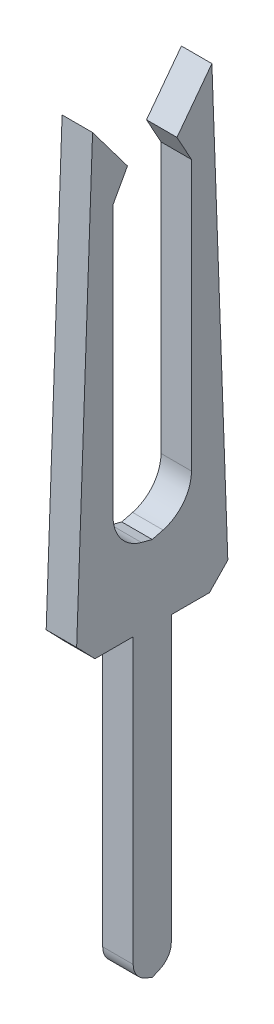
ISO-10303-21;
HEADER;
FILE_DESCRIPTION(('STEP AP214'),'2;1');
FILE_NAME('part.step','',(''),(''),'','','');
FILE_SCHEMA(('AUTOMOTIVE_DESIGN { 1 0 10303 214 1 1 1 1 }'));
ENDSEC;
DATA;
#1=APPLICATION_CONTEXT('core data for automotive mechanical design processes');
#2=APPLICATION_PROTOCOL_DEFINITION('international standard','automotive_design',2000,#1);
#3=PRODUCT_CONTEXT('',#1,'mechanical');
#4=PRODUCT('Part','Part','',(#3));
#5=PRODUCT_RELATED_PRODUCT_CATEGORY('part','',(#4));
#6=PRODUCT_DEFINITION_FORMATION('','',#4);
#7=PRODUCT_DEFINITION_CONTEXT('part definition',#1,'design');
#8=PRODUCT_DEFINITION('design','',#6,#7);
#9=PRODUCT_DEFINITION_SHAPE('','',#8);
#10=(LENGTH_UNIT() NAMED_UNIT(*) SI_UNIT(.MILLI.,.METRE.));
#11=(NAMED_UNIT(*) PLANE_ANGLE_UNIT() SI_UNIT($,.RADIAN.));
#12=(NAMED_UNIT(*) SI_UNIT($,.STERADIAN.) SOLID_ANGLE_UNIT());
#13=UNCERTAINTY_MEASURE_WITH_UNIT(LENGTH_MEASURE(1.E-05),#10,'distance_accuracy_value','');
#14=(GEOMETRIC_REPRESENTATION_CONTEXT(3) GLOBAL_UNCERTAINTY_ASSIGNED_CONTEXT((#13)) GLOBAL_UNIT_ASSIGNED_CONTEXT((#10,
#11,#12)) REPRESENTATION_CONTEXT('',''));
#15=CARTESIAN_POINT('',(0.,0.,0.));
#16=DIRECTION('',(0.,0.,1.));
#17=DIRECTION('',(1.,0.,0.));
#18=AXIS2_PLACEMENT_3D('',#15,#16,#17);
#19=CARTESIAN_POINT('',(0.4,2.15627423693323,0.277438328452502));
#20=DIRECTION('',(0.,0.694137309805425,0.71984261831048));
#21=DIRECTION('',(0.,-0.71984261831048,0.694137309805425));
#22=AXIS2_PLACEMENT_3D('',#19,#20,#21);
#23=PLANE('',#22);
#24=DIRECTION('',(0.,0.71984261831048,-0.694137309805425));
#25=VECTOR('',#24,1.);
#26=CARTESIAN_POINT('',(0.,2.15627423693323,0.277438328452502));
#27=LINE('',#26,#25);
#28=CARTESIAN_POINT('',(0.,1.90643942765456,0.518351630884458));
#29=VERTEX_POINT('',#28);
#30=CARTESIAN_POINT('',(0.,2.15627423693323,0.277438328452502));
#31=VERTEX_POINT('',#30);
#32=EDGE_CURVE('E212',#29,#31,#27,.T.);
#33=ORIENTED_EDGE('',*,*,#32,.T.);
#34=DIRECTION('',(-1.,0.,0.));
#35=VECTOR('',#34,1.);
#36=CARTESIAN_POINT('',(0.4,2.15627423693323,0.277438328452502));
#37=LINE('',#36,#35);
#38=CARTESIAN_POINT('',(0.4,2.15627423693323,0.277438328452502));
#39=VERTEX_POINT('',#38);
#40=EDGE_CURVE('E11',#39,#31,#37,.T.);
#41=ORIENTED_EDGE('',*,*,#40,.F.);
#42=DIRECTION('',(0.,0.71984261831048,-0.694137309805425));
#43=VECTOR('',#42,1.);
#44=CARTESIAN_POINT('',(0.4,2.15627423693323,0.277438328452502));
#45=LINE('',#44,#43);
#46=CARTESIAN_POINT('',(0.4,1.90643942765456,0.518351630884458));
#47=VERTEX_POINT('',#46);
#48=EDGE_CURVE('E254',#47,#39,#45,.T.);
#49=ORIENTED_EDGE('',*,*,#48,.F.);
#50=DIRECTION('',(-1.,0.,0.));
#51=VECTOR('',#50,1.);
#52=CARTESIAN_POINT('',(0.4,1.90643942765456,0.518351630884458));
#53=LINE('',#52,#51);
#54=EDGE_CURVE('E208',#47,#29,#53,.T.);
#55=ORIENTED_EDGE('',*,*,#54,.T.);
#56=EDGE_LOOP('',(#33,#41,#49,#55));
#57=FACE_BOUND('',#56,.T.);
#58=ADVANCED_FACE('F32',(#57),#23,.F.);
#59=CARTESIAN_POINT('',(0.4,7.90643942765456,0.486576567456251));
#60=DIRECTION('',(0.,-0.036346790272175,0.99933923711466));
#61=DIRECTION('',(0.,-0.99933923711466,-0.036346790272175));
#62=AXIS2_PLACEMENT_3D('',#59,#60,#61);
#63=PLANE('',#62);
#64=DIRECTION('',(0.,0.99933923711466,0.036346790272175));
#65=VECTOR('',#64,1.);
#66=CARTESIAN_POINT('',(0.,7.90643942765456,0.486576567456251));
#67=LINE('',#66,#65);
#68=CARTESIAN_POINT('',(0.,7.90643942765456,0.486576567456251));
#69=VERTEX_POINT('',#68);
#70=EDGE_CURVE('E215',#31,#69,#67,.T.);
#71=ORIENTED_EDGE('',*,*,#70,.T.);
#72=DIRECTION('',(-1.,0.,0.));
#73=VECTOR('',#72,1.);
#74=CARTESIAN_POINT('',(0.4,7.90643942765456,0.486576567456251));
#75=LINE('',#74,#73);
#76=CARTESIAN_POINT('',(0.4,7.90643942765456,0.486576567456251));
#77=VERTEX_POINT('',#76);
#78=EDGE_CURVE('E40',#77,#69,#75,.T.);
#79=ORIENTED_EDGE('',*,*,#78,.F.);
#80=DIRECTION('',(0.,0.99933923711466,0.036346790272175));
#81=VECTOR('',#80,1.);
#82=CARTESIAN_POINT('',(0.4,7.90643942765456,0.486576567456251));
#83=LINE('',#82,#81);
#84=EDGE_CURVE('E133',#39,#77,#83,.T.);
#85=ORIENTED_EDGE('',*,*,#84,.F.);
#86=ORIENTED_EDGE('',*,*,#40,.T.);
#87=EDGE_LOOP('',(#71,#79,#85,#86));
#88=FACE_BOUND('',#87,.T.);
#89=ADVANCED_FACE('F382',(#88),#63,.F.);
#90=CARTESIAN_POINT('',(0.4,7.29691604158744,0.944947879463951));
#91=DIRECTION('',(0.,-0.601030672473663,-0.799225957252301));
#92=DIRECTION('',(0.,0.799225957252301,-0.601030672473663));
#93=AXIS2_PLACEMENT_3D('',#90,#91,#92);
#94=PLANE('',#93);
#95=DIRECTION('',(0.,-0.799225957252301,0.601030672473663));
#96=VECTOR('',#95,1.);
#97=CARTESIAN_POINT('',(0.,7.29691604158744,0.944947879463951));
#98=LINE('',#97,#96);
#99=CARTESIAN_POINT('',(0.,7.29691604158744,0.944947879463951));
#100=VERTEX_POINT('',#99);
#101=EDGE_CURVE('E217',#69,#100,#98,.T.);
#102=ORIENTED_EDGE('',*,*,#101,.T.);
#103=DIRECTION('',(-1.,0.,0.));
#104=VECTOR('',#103,1.);
#105=CARTESIAN_POINT('',(0.4,7.29691604158744,0.944947879463951));
#106=LINE('',#105,#104);
#107=CARTESIAN_POINT('',(0.4,7.29691604158744,0.944947879463951));
#108=VERTEX_POINT('',#107);
#109=EDGE_CURVE('E303',#108,#100,#106,.T.);
#110=ORIENTED_EDGE('',*,*,#109,.F.);
#111=DIRECTION('',(0.,-0.799225957252301,0.601030672473663));
#112=VECTOR('',#111,1.);
#113=CARTESIAN_POINT('',(0.4,7.29691604158744,0.944947879463951));
#114=LINE('',#113,#112);
#115=EDGE_CURVE('E311',#77,#108,#114,.T.);
#116=ORIENTED_EDGE('',*,*,#115,.F.);
#117=ORIENTED_EDGE('',*,*,#78,.T.);
#118=EDGE_LOOP('',(#102,#110,#116,#117));
#119=FACE_BOUND('',#118,.T.);
#120=ADVANCED_FACE('F309',(#119),#94,.F.);
#121=CARTESIAN_POINT('',(0.4,6.95011825296304,0.754777343997982));
#122=DIRECTION('',(0.,0.480815317239039,-0.876821892238283));
#123=DIRECTION('',(0.,0.876821892238283,0.480815317239039));
#124=AXIS2_PLACEMENT_3D('',#121,#122,#123);
#125=PLANE('',#124);
#126=DIRECTION('',(0.,-0.876821892238283,-0.480815317239039));
#127=VECTOR('',#126,1.);
#128=CARTESIAN_POINT('',(0.,6.95011825296304,0.754777343997982));
#129=LINE('',#128,#127);
#130=CARTESIAN_POINT('',(0.,6.95011825296304,0.754777343997982));
#131=VERTEX_POINT('',#130);
#132=EDGE_CURVE('E219',#100,#131,#129,.T.);
#133=ORIENTED_EDGE('',*,*,#132,.T.);
#134=DIRECTION('',(-1.,0.,0.));
#135=VECTOR('',#134,1.);
#136=CARTESIAN_POINT('',(0.4,6.95011825296304,0.754777343997982));
#137=LINE('',#136,#135);
#138=CARTESIAN_POINT('',(0.4,6.95011825296304,0.754777343997982));
#139=VERTEX_POINT('',#138);
#140=EDGE_CURVE('E300',#139,#131,#137,.T.);
#141=ORIENTED_EDGE('',*,*,#140,.F.);
#142=DIRECTION('',(0.,-0.876821892238283,-0.480815317239039));
#143=VECTOR('',#142,1.);
#144=CARTESIAN_POINT('',(0.4,6.95011825296304,0.754777343997982));
#145=LINE('',#144,#143);
#146=EDGE_CURVE('E329',#108,#139,#145,.T.);
#147=ORIENTED_EDGE('',*,*,#146,.F.);
#148=ORIENTED_EDGE('',*,*,#109,.T.);
#149=EDGE_LOOP('',(#133,#141,#147,#148));
#150=FACE_BOUND('',#149,.T.);
#151=ADVANCED_FACE('F320',(#150),#125,.F.);
#152=CARTESIAN_POINT('',(0.4,3.40759606010662,0.754710604299908));
#153=DIRECTION('',(0.,1.88395991410638E-05,-0.999999999822535));
#154=DIRECTION('',(0.,0.999999999822535,1.88395991410638E-05));
#155=AXIS2_PLACEMENT_3D('',#152,#153,#154);
#156=PLANE('',#155);
#157=DIRECTION('',(0.,-0.999999999822535,-1.88395991410638E-05));
#158=VECTOR('',#157,1.);
#159=CARTESIAN_POINT('',(0.,3.40759606010662,0.754710604299908));
#160=LINE('',#159,#158);
#161=CARTESIAN_POINT('',(0.,3.40759606010662,0.754710604299908));
#162=VERTEX_POINT('',#161);
#163=EDGE_CURVE('E221',#131,#162,#160,.T.);
#164=ORIENTED_EDGE('',*,*,#163,.T.);
#165=DIRECTION('',(-1.,0.,0.));
#166=VECTOR('',#165,1.);
#167=CARTESIAN_POINT('',(0.4,3.40759606010662,0.754710604299908));
#168=LINE('',#167,#166);
#169=CARTESIAN_POINT('',(0.4,3.40759606010662,0.754710604299908));
#170=VERTEX_POINT('',#169);
#171=EDGE_CURVE('E297',#170,#162,#168,.T.);
#172=ORIENTED_EDGE('',*,*,#171,.F.);
#173=DIRECTION('',(0.,-0.999999999822535,-1.88395991410638E-05));
#174=VECTOR('',#173,1.);
#175=CARTESIAN_POINT('',(0.4,3.40759606010662,0.754710604299908));
#176=LINE('',#175,#174);
#177=EDGE_CURVE('E326',#139,#170,#176,.T.);
#178=ORIENTED_EDGE('',*,*,#177,.F.);
#179=ORIENTED_EDGE('',*,*,#140,.T.);
#180=EDGE_LOOP('',(#164,#172,#178,#179));
#181=FACE_BOUND('',#180,.T.);
#182=ADVANCED_FACE('F324',(#181),#156,.F.);
#183=CARTESIAN_POINT('',(0.4,3.40758664030705,1.25471060421118));
#184=DIRECTION('',(-1.,0.,0.));
#185=DIRECTION('',(0.,0.,1.));
#186=AXIS2_PLACEMENT_3D('',#183,#184,#185);
#187=CYLINDRICAL_SURFACE('',#186,0.5);
#188=CARTESIAN_POINT('',(0.,3.40758664030705,1.25471060421118));
#189=DIRECTION('',(-1.,0.,0.));
#190=DIRECTION('',(0.,0.,-1.));
#191=AXIS2_PLACEMENT_3D('',#188,#189,#190);
#192=CIRCLE('',#191,0.5);
#193=CARTESIAN_POINT('',(0.,2.92391221511593,1.127986295509));
#194=VERTEX_POINT('',#193);
#195=EDGE_CURVE('E223',#162,#194,#192,.T.);
#196=ORIENTED_EDGE('',*,*,#195,.T.);
#197=DIRECTION('',(-1.,0.,0.));
#198=VECTOR('',#197,1.);
#199=CARTESIAN_POINT('',(0.4,2.92391221511593,1.127986295509));
#200=LINE('',#199,#198);
#201=CARTESIAN_POINT('',(0.4,2.92391221511593,1.127986295509));
#202=VERTEX_POINT('',#201);
#203=EDGE_CURVE('E294',#202,#194,#200,.T.);
#204=ORIENTED_EDGE('',*,*,#203,.F.);
#205=CARTESIAN_POINT('',(0.4,3.40758664030705,1.25471060421118));
#206=DIRECTION('',(-1.,0.,0.));
#207=DIRECTION('',(0.,0.,-1.));
#208=AXIS2_PLACEMENT_3D('',#205,#206,#207);
#209=CIRCLE('',#208,0.5);
#210=EDGE_CURVE('E328',#170,#202,#209,.T.);
#211=ORIENTED_EDGE('',*,*,#210,.F.);
#212=ORIENTED_EDGE('',*,*,#171,.T.);
#213=EDGE_LOOP('',(#196,#204,#211,#212));
#214=FACE_BOUND('',#213,.T.);
#215=ADVANCED_FACE('F395',(#214),#187,.F.);
#216=CARTESIAN_POINT('',(0.4,2.88671780777912,1.26994787946395));
#217=DIRECTION('',(0.,-0.967348850382229,-0.253448617404358));
#218=DIRECTION('',(0.,0.253448617404358,-0.967348850382229));
#219=AXIS2_PLACEMENT_3D('',#216,#217,#218);
#220=PLANE('',#219);
#221=DIRECTION('',(0.,-0.253448617404358,0.967348850382229));
#222=VECTOR('',#221,1.);
#223=CARTESIAN_POINT('',(0.,2.88671780777912,1.26994787946395));
#224=LINE('',#223,#222);
#225=CARTESIAN_POINT('',(0.,2.88671780777912,1.26994787946395));
#226=VERTEX_POINT('',#225);
#227=EDGE_CURVE('E225',#194,#226,#224,.T.);
#228=ORIENTED_EDGE('',*,*,#227,.T.);
#229=DIRECTION('',(-1.,0.,0.));
#230=VECTOR('',#229,1.);
#231=CARTESIAN_POINT('',(0.4,2.88671780777912,1.26994787946395));
#232=LINE('',#231,#230);
#233=CARTESIAN_POINT('',(0.4,2.88671780777912,1.26994787946395));
#234=VERTEX_POINT('',#233);
#235=EDGE_CURVE('E291',#234,#226,#232,.T.);
#236=ORIENTED_EDGE('',*,*,#235,.F.);
#237=DIRECTION('',(0.,-0.253448617404358,0.967348850382229));
#238=VECTOR('',#237,1.);
#239=CARTESIAN_POINT('',(0.4,2.88671780777912,1.26994787946395));
#240=LINE('',#239,#238);
#241=EDGE_CURVE('E331',#202,#234,#240,.T.);
#242=ORIENTED_EDGE('',*,*,#241,.F.);
#243=ORIENTED_EDGE('',*,*,#203,.T.);
#244=EDGE_LOOP('',(#228,#236,#242,#243));
#245=FACE_BOUND('',#244,.T.);
#246=ADVANCED_FACE('F398',(#245),#220,.F.);
#247=CARTESIAN_POINT('',(0.4,2.88671780777912,1.26994787946395));
#248=DIRECTION('',(0.,-0.967348850382229,0.253448617404358));
#249=DIRECTION('',(0.,-0.253448617404358,-0.967348850382229));
#250=AXIS2_PLACEMENT_3D('',#247,#248,#249);
#251=PLANE('',#250);
#252=DIRECTION('',(0.,0.253448617404358,0.967348850382229));
#253=VECTOR('',#252,1.);
#254=CARTESIAN_POINT('',(0.,2.88671780777912,1.26994787946395));
#255=LINE('',#254,#253);
#256=CARTESIAN_POINT('',(0.,2.92391221511593,1.4119094634189));
#257=VERTEX_POINT('',#256);
#258=EDGE_CURVE('E227',#226,#257,#255,.T.);
#259=ORIENTED_EDGE('',*,*,#258,.T.);
#260=DIRECTION('',(-1.,0.,0.));
#261=VECTOR('',#260,1.);
#262=CARTESIAN_POINT('',(0.4,2.92391221511593,1.4119094634189));
#263=LINE('',#262,#261);
#264=CARTESIAN_POINT('',(0.4,2.92391221511593,1.4119094634189));
#265=VERTEX_POINT('',#264);
#266=EDGE_CURVE('E288',#265,#257,#263,.T.);
#267=ORIENTED_EDGE('',*,*,#266,.F.);
#268=DIRECTION('',(0.,0.253448617404358,0.967348850382229));
#269=VECTOR('',#268,1.);
#270=CARTESIAN_POINT('',(0.4,2.88671780777912,1.26994787946395));
#271=LINE('',#270,#269);
#272=EDGE_CURVE('E337',#234,#265,#271,.T.);
#273=ORIENTED_EDGE('',*,*,#272,.F.);
#274=ORIENTED_EDGE('',*,*,#235,.T.);
#275=EDGE_LOOP('',(#259,#267,#273,#274));
#276=FACE_BOUND('',#275,.T.);
#277=ADVANCED_FACE('F402',(#276),#251,.F.);
#278=CARTESIAN_POINT('',(0.4,3.40758664030705,1.28518515471672));
#279=DIRECTION('',(-1.,0.,0.));
#280=DIRECTION('',(0.,0.,1.));
#281=AXIS2_PLACEMENT_3D('',#278,#279,#280);
#282=CYLINDRICAL_SURFACE('',#281,0.5);
#283=CARTESIAN_POINT('',(0.,3.40758664030705,1.28518515471672));
#284=DIRECTION('',(-1.,0.,0.));
#285=DIRECTION('',(0.,0.,1.));
#286=AXIS2_PLACEMENT_3D('',#283,#284,#285);
#287=CIRCLE('',#286,0.5);
#288=CARTESIAN_POINT('',(0.,3.40759606010662,1.78518515462799));
#289=VERTEX_POINT('',#288);
#290=EDGE_CURVE('E229',#257,#289,#287,.T.);
#291=ORIENTED_EDGE('',*,*,#290,.T.);
#292=DIRECTION('',(-1.,0.,0.));
#293=VECTOR('',#292,1.);
#294=CARTESIAN_POINT('',(0.4,3.40759606010662,1.78518515462799));
#295=LINE('',#294,#293);
#296=CARTESIAN_POINT('',(0.4,3.40759606010662,1.78518515462799));
#297=VERTEX_POINT('',#296);
#298=EDGE_CURVE('E285',#297,#289,#295,.T.);
#299=ORIENTED_EDGE('',*,*,#298,.F.);
#300=CARTESIAN_POINT('',(0.4,3.40758664030705,1.28518515471672));
#301=DIRECTION('',(-1.,0.,0.));
#302=DIRECTION('',(0.,0.,1.));
#303=AXIS2_PLACEMENT_3D('',#300,#301,#302);
#304=CIRCLE('',#303,0.5);
#305=EDGE_CURVE('E339',#265,#297,#304,.T.);
#306=ORIENTED_EDGE('',*,*,#305,.F.);
#307=ORIENTED_EDGE('',*,*,#266,.T.);
#308=EDGE_LOOP('',(#291,#299,#306,#307));
#309=FACE_BOUND('',#308,.T.);
#310=ADVANCED_FACE('F406',(#309),#282,.F.);
#311=CARTESIAN_POINT('',(0.4,3.40759606010662,1.78518515462799));
#312=DIRECTION('',(0.,1.88395991408802E-05,0.999999999822535));
#313=DIRECTION('',(0.,-0.999999999822535,1.88395991408802E-05));
#314=AXIS2_PLACEMENT_3D('',#311,#312,#313);
#315=PLANE('',#314);
#316=DIRECTION('',(0.,0.999999999822535,-1.88395991408802E-05));
#317=VECTOR('',#316,1.);
#318=CARTESIAN_POINT('',(0.,3.40759606010662,1.78518515462799));
#319=LINE('',#318,#317);
#320=CARTESIAN_POINT('',(0.,6.95011825296304,1.78511841492992));
#321=VERTEX_POINT('',#320);
#322=EDGE_CURVE('E231',#289,#321,#319,.T.);
#323=ORIENTED_EDGE('',*,*,#322,.T.);
#324=DIRECTION('',(-1.,0.,0.));
#325=VECTOR('',#324,1.);
#326=CARTESIAN_POINT('',(0.4,6.95011825296304,1.78511841492992));
#327=LINE('',#326,#325);
#328=CARTESIAN_POINT('',(0.4,6.95011825296304,1.78511841492992));
#329=VERTEX_POINT('',#328);
#330=EDGE_CURVE('E282',#329,#321,#327,.T.);
#331=ORIENTED_EDGE('',*,*,#330,.F.);
#332=DIRECTION('',(0.,0.999999999822535,-1.88395991408802E-05));
#333=VECTOR('',#332,1.);
#334=CARTESIAN_POINT('',(0.4,3.40759606010662,1.78518515462799));
#335=LINE('',#334,#333);
#336=EDGE_CURVE('E341',#297,#329,#335,.T.);
#337=ORIENTED_EDGE('',*,*,#336,.F.);
#338=ORIENTED_EDGE('',*,*,#298,.T.);
#339=EDGE_LOOP('',(#323,#331,#337,#338));
#340=FACE_BOUND('',#339,.T.);
#341=ADVANCED_FACE('F410',(#340),#315,.F.);
#342=CARTESIAN_POINT('',(0.4,6.95011825296304,1.78511841492992));
#343=DIRECTION('',(0.,0.480815317239038,0.876821892238283));
#344=DIRECTION('',(0.,-0.876821892238283,0.480815317239038));
#345=AXIS2_PLACEMENT_3D('',#342,#343,#344);
#346=PLANE('',#345);
#347=DIRECTION('',(0.,0.876821892238283,-0.480815317239038));
#348=VECTOR('',#347,1.);
#349=CARTESIAN_POINT('',(0.,6.95011825296304,1.78511841492992));
#350=LINE('',#349,#348);
#351=CARTESIAN_POINT('',(0.,7.29691604158744,1.59494787946395));
#352=VERTEX_POINT('',#351);
#353=EDGE_CURVE('E233',#321,#352,#350,.T.);
#354=ORIENTED_EDGE('',*,*,#353,.T.);
#355=DIRECTION('',(-1.,0.,0.));
#356=VECTOR('',#355,1.);
#357=CARTESIAN_POINT('',(0.4,7.29691604158744,1.59494787946395));
#358=LINE('',#357,#356);
#359=CARTESIAN_POINT('',(0.4,7.29691604158744,1.59494787946395));
#360=VERTEX_POINT('',#359);
#361=EDGE_CURVE('E279',#360,#352,#358,.T.);
#362=ORIENTED_EDGE('',*,*,#361,.F.);
#363=DIRECTION('',(0.,0.876821892238283,-0.480815317239038));
#364=VECTOR('',#363,1.);
#365=CARTESIAN_POINT('',(0.4,6.95011825296304,1.78511841492992));
#366=LINE('',#365,#364);
#367=EDGE_CURVE('E343',#329,#360,#366,.T.);
#368=ORIENTED_EDGE('',*,*,#367,.F.);
#369=ORIENTED_EDGE('',*,*,#330,.T.);
#370=EDGE_LOOP('',(#354,#362,#368,#369));
#371=FACE_BOUND('',#370,.T.);
#372=ADVANCED_FACE('F414',(#371),#346,.F.);
#373=CARTESIAN_POINT('',(0.4,7.29691604158744,1.59494787946395));
#374=DIRECTION('',(0.,-0.601030672473662,0.799225957252301));
#375=DIRECTION('',(0.,-0.799225957252301,-0.601030672473662));
#376=AXIS2_PLACEMENT_3D('',#373,#374,#375);
#377=PLANE('',#376);
#378=DIRECTION('',(0.,0.799225957252301,0.601030672473662));
#379=VECTOR('',#378,1.);
#380=CARTESIAN_POINT('',(0.,7.29691604158744,1.59494787946395));
#381=LINE('',#380,#379);
#382=CARTESIAN_POINT('',(0.,7.90643942765456,2.05331919147165));
#383=VERTEX_POINT('',#382);
#384=EDGE_CURVE('E235',#352,#383,#381,.T.);
#385=ORIENTED_EDGE('',*,*,#384,.T.);
#386=DIRECTION('',(-1.,0.,0.));
#387=VECTOR('',#386,1.);
#388=CARTESIAN_POINT('',(0.4,7.90643942765456,2.05331919147165));
#389=LINE('',#388,#387);
#390=CARTESIAN_POINT('',(0.4,7.90643942765456,2.05331919147165));
#391=VERTEX_POINT('',#390);
#392=EDGE_CURVE('E276',#391,#383,#389,.T.);
#393=ORIENTED_EDGE('',*,*,#392,.F.);
#394=DIRECTION('',(0.,0.799225957252301,0.601030672473662));
#395=VECTOR('',#394,1.);
#396=CARTESIAN_POINT('',(0.4,7.29691604158744,1.59494787946395));
#397=LINE('',#396,#395);
#398=EDGE_CURVE('E345',#360,#391,#397,.T.);
#399=ORIENTED_EDGE('',*,*,#398,.F.);
#400=ORIENTED_EDGE('',*,*,#361,.T.);
#401=EDGE_LOOP('',(#385,#393,#399,#400));
#402=FACE_BOUND('',#401,.T.);
#403=ADVANCED_FACE('F418',(#402),#377,.F.);
#404=CARTESIAN_POINT('',(0.4,7.90643942765456,2.05331919147165));
#405=DIRECTION('',(0.,-0.0363467902721749,-0.99933923711466));
#406=DIRECTION('',(0.,0.99933923711466,-0.0363467902721749));
#407=AXIS2_PLACEMENT_3D('',#404,#405,#406);
#408=PLANE('',#407);
#409=DIRECTION('',(0.,-0.99933923711466,0.0363467902721749));
#410=VECTOR('',#409,1.);
#411=CARTESIAN_POINT('',(0.,7.90643942765456,2.05331919147165));
#412=LINE('',#411,#410);
#413=CARTESIAN_POINT('',(0.,2.15627423693323,2.26245743047539));
#414=VERTEX_POINT('',#413);
#415=EDGE_CURVE('E237',#383,#414,#412,.T.);
#416=ORIENTED_EDGE('',*,*,#415,.T.);
#417=DIRECTION('',(-1.,0.,0.));
#418=VECTOR('',#417,1.);
#419=CARTESIAN_POINT('',(0.4,2.15627423693323,2.26245743047539));
#420=LINE('',#419,#418);
#421=CARTESIAN_POINT('',(0.4,2.15627423693323,2.26245743047539));
#422=VERTEX_POINT('',#421);
#423=EDGE_CURVE('E273',#422,#414,#420,.T.);
#424=ORIENTED_EDGE('',*,*,#423,.F.);
#425=DIRECTION('',(0.,-0.99933923711466,0.0363467902721749));
#426=VECTOR('',#425,1.);
#427=CARTESIAN_POINT('',(0.4,7.90643942765456,2.05331919147165));
#428=LINE('',#427,#426);
#429=EDGE_CURVE('E347',#391,#422,#428,.T.);
#430=ORIENTED_EDGE('',*,*,#429,.F.);
#431=ORIENTED_EDGE('',*,*,#392,.T.);
#432=EDGE_LOOP('',(#416,#424,#430,#431));
#433=FACE_BOUND('',#432,.T.);
#434=ADVANCED_FACE('F422',(#433),#408,.F.);
#435=CARTESIAN_POINT('',(0.4,2.15627423693323,2.26245743047539));
#436=DIRECTION('',(0.,0.694137309805425,-0.71984261831048));
#437=DIRECTION('',(0.,0.71984261831048,0.694137309805426));
#438=AXIS2_PLACEMENT_3D('',#435,#436,#437);
#439=PLANE('',#438);
#440=DIRECTION('',(0.,-0.71984261831048,-0.694137309805426));
#441=VECTOR('',#440,1.);
#442=CARTESIAN_POINT('',(0.,2.15627423693323,2.26245743047539));
#443=LINE('',#442,#441);
#444=CARTESIAN_POINT('',(0.,1.90643942765456,2.02154412804344));
#445=VERTEX_POINT('',#444);
#446=EDGE_CURVE('E239',#414,#445,#443,.T.);
#447=ORIENTED_EDGE('',*,*,#446,.T.);
#448=DIRECTION('',(-1.,0.,0.));
#449=VECTOR('',#448,1.);
#450=CARTESIAN_POINT('',(0.4,1.90643942765456,2.02154412804344));
#451=LINE('',#450,#449);
#452=CARTESIAN_POINT('',(0.4,1.90643942765456,2.02154412804344));
#453=VERTEX_POINT('',#452);
#454=EDGE_CURVE('E270',#453,#445,#451,.T.);
#455=ORIENTED_EDGE('',*,*,#454,.F.);
#456=DIRECTION('',(0.,-0.71984261831048,-0.694137309805426));
#457=VECTOR('',#456,1.);
#458=CARTESIAN_POINT('',(0.4,2.15627423693323,2.26245743047539));
#459=LINE('',#458,#457);
#460=EDGE_CURVE('E349',#422,#453,#459,.T.);
#461=ORIENTED_EDGE('',*,*,#460,.F.);
#462=ORIENTED_EDGE('',*,*,#423,.T.);
#463=EDGE_LOOP('',(#447,#455,#461,#462));
#464=FACE_BOUND('',#463,.T.);
#465=ADVANCED_FACE('F426',(#464),#439,.F.);
#466=CARTESIAN_POINT('',(0.4,1.90643942765456,2.02154412804344));
#467=DIRECTION('',(0.,1.,0.));
#468=DIRECTION('',(0.,0.,1.));
#469=AXIS2_PLACEMENT_3D('',#466,#467,#468);
#470=PLANE('',#469);
#471=DIRECTION('',(0.,0.,-1.));
#472=VECTOR('',#471,1.);
#473=CARTESIAN_POINT('',(0.,1.90643942765456,2.02154412804344));
#474=LINE('',#473,#472);
#475=CARTESIAN_POINT('',(0.,1.90643942765456,1.51994787946395));
#476=VERTEX_POINT('',#475);
#477=EDGE_CURVE('E241',#445,#476,#474,.T.);
#478=ORIENTED_EDGE('',*,*,#477,.T.);
#479=DIRECTION('',(-1.,0.,0.));
#480=VECTOR('',#479,1.);
#481=CARTESIAN_POINT('',(0.4,1.90643942765456,1.51994787946395));
#482=LINE('',#481,#480);
#483=CARTESIAN_POINT('',(0.4,1.90643942765456,1.51994787946395));
#484=VERTEX_POINT('',#483);
#485=EDGE_CURVE('E267',#484,#476,#482,.T.);
#486=ORIENTED_EDGE('',*,*,#485,.F.);
#487=DIRECTION('',(0.,0.,-1.));
#488=VECTOR('',#487,1.);
#489=CARTESIAN_POINT('',(0.4,1.90643942765456,2.02154412804344));
#490=LINE('',#489,#488);
#491=EDGE_CURVE('E351',#453,#484,#490,.T.);
#492=ORIENTED_EDGE('',*,*,#491,.F.);
#493=ORIENTED_EDGE('',*,*,#454,.T.);
#494=EDGE_LOOP('',(#478,#486,#492,#493));
#495=FACE_BOUND('',#494,.T.);
#496=ADVANCED_FACE('F430',(#495),#470,.F.);
#497=CARTESIAN_POINT('',(0.4,1.90643942765456,1.51994787946395));
#498=DIRECTION('',(0.,0.,-1.));
#499=DIRECTION('',(0.,1.,0.));
#500=AXIS2_PLACEMENT_3D('',#497,#498,#499);
#501=PLANE('',#500);
#502=DIRECTION('',(0.,-1.,0.));
#503=VECTOR('',#502,1.);
#504=CARTESIAN_POINT('',(0.,1.90643942765456,1.51994787946395));
#505=LINE('',#504,#503);
#506=CARTESIAN_POINT('',(0.,-1.82003778744792,1.51994787946395));
#507=VERTEX_POINT('',#506);
#508=EDGE_CURVE('E243',#476,#507,#505,.T.);
#509=ORIENTED_EDGE('',*,*,#508,.T.);
#510=DIRECTION('',(-1.,0.,0.));
#511=VECTOR('',#510,1.);
#512=CARTESIAN_POINT('',(0.4,-1.82003778744792,1.51994787946395));
#513=LINE('',#512,#511);
#514=CARTESIAN_POINT('',(0.4,-1.82003778744792,1.51994787946395));
#515=VERTEX_POINT('',#514);
#516=EDGE_CURVE('E264',#515,#507,#513,.T.);
#517=ORIENTED_EDGE('',*,*,#516,.F.);
#518=DIRECTION('',(0.,-1.,0.));
#519=VECTOR('',#518,1.);
#520=CARTESIAN_POINT('',(0.4,1.90643942765456,1.51994787946395));
#521=LINE('',#520,#519);
#522=EDGE_CURVE('E353',#484,#515,#521,.T.);
#523=ORIENTED_EDGE('',*,*,#522,.F.);
#524=ORIENTED_EDGE('',*,*,#485,.T.);
#525=EDGE_LOOP('',(#509,#517,#523,#524));
#526=FACE_BOUND('',#525,.T.);
#527=ADVANCED_FACE('F434',(#526),#501,.F.);
#528=CARTESIAN_POINT('',(0.4,-1.82003778744792,1.26994787946395));
#529=DIRECTION('',(-1.,0.,0.));
#530=DIRECTION('',(0.,0.,1.));
#531=AXIS2_PLACEMENT_3D('',#528,#529,#530);
#532=CYLINDRICAL_SURFACE('',#531,0.249999999999999);
#533=CARTESIAN_POINT('',(0.,-1.82003778744792,1.26994787946395));
#534=DIRECTION('',(1.,0.,0.));
#535=DIRECTION('',(0.,0.,-1.));
#536=AXIS2_PLACEMENT_3D('',#533,#534,#535);
#537=CIRCLE('',#536,0.249999999999999);
#538=CARTESIAN_POINT('',(0.,-2.04853794703578,1.37137606621853));
#539=VERTEX_POINT('',#538);
#540=EDGE_CURVE('E245',#507,#539,#537,.T.);
#541=ORIENTED_EDGE('',*,*,#540,.T.);
#542=DIRECTION('',(-1.,0.,0.));
#543=VECTOR('',#542,1.);
#544=CARTESIAN_POINT('',(0.4,-2.04853794703578,1.37137606621853));
#545=LINE('',#544,#543);
#546=CARTESIAN_POINT('',(0.4,-2.04853794703578,1.37137606621853));
#547=VERTEX_POINT('',#546);
#548=EDGE_CURVE('E261',#547,#539,#545,.T.);
#549=ORIENTED_EDGE('',*,*,#548,.F.);
#550=CARTESIAN_POINT('',(0.4,-1.82003778744792,1.26994787946395));
#551=DIRECTION('',(1.,0.,0.));
#552=DIRECTION('',(0.,0.,-1.));
#553=AXIS2_PLACEMENT_3D('',#550,#551,#552);
#554=CIRCLE('',#553,0.249999999999999);
#555=EDGE_CURVE('E355',#515,#547,#554,.T.);
#556=ORIENTED_EDGE('',*,*,#555,.F.);
#557=ORIENTED_EDGE('',*,*,#516,.T.);
#558=EDGE_LOOP('',(#541,#549,#556,#557));
#559=FACE_BOUND('',#558,.T.);
#560=ADVANCED_FACE('F438',(#559),#532,.T.);
#561=CARTESIAN_POINT('',(0.4,-2.04853794703578,1.37137606621853));
#562=DIRECTION('',(0.,0.914000638351446,-0.405712747018317));
#563=DIRECTION('',(0.,0.405712747018317,0.914000638351446));
#564=AXIS2_PLACEMENT_3D('',#561,#562,#563);
#565=PLANE('',#564);
#566=DIRECTION('',(0.,-0.405712747018317,-0.914000638351446));
#567=VECTOR('',#566,1.);
#568=CARTESIAN_POINT('',(0.,-2.04853794703578,1.37137606621853));
#569=LINE('',#568,#567);
#570=CARTESIAN_POINT('',(0.,-2.09356057234545,1.26994787946395));
#571=VERTEX_POINT('',#570);
#572=EDGE_CURVE('E247',#539,#571,#569,.T.);
#573=ORIENTED_EDGE('',*,*,#572,.T.);
#574=DIRECTION('',(-1.,0.,0.));
#575=VECTOR('',#574,1.);
#576=CARTESIAN_POINT('',(0.4,-2.09356057234545,1.26994787946395));
#577=LINE('',#576,#575);
#578=CARTESIAN_POINT('',(0.4,-2.09356057234545,1.26994787946395));
#579=VERTEX_POINT('',#578);
#580=EDGE_CURVE('E258',#579,#571,#577,.T.);
#581=ORIENTED_EDGE('',*,*,#580,.F.);
#582=DIRECTION('',(0.,-0.405712747018317,-0.914000638351446));
#583=VECTOR('',#582,1.);
#584=CARTESIAN_POINT('',(0.4,-2.04853794703578,1.37137606621853));
#585=LINE('',#584,#583);
#586=EDGE_CURVE('E357',#547,#579,#585,.T.);
#587=ORIENTED_EDGE('',*,*,#586,.F.);
#588=ORIENTED_EDGE('',*,*,#548,.T.);
#589=EDGE_LOOP('',(#573,#581,#587,#588));
#590=FACE_BOUND('',#589,.T.);
#591=ADVANCED_FACE('F363',(#590),#565,.F.);
#592=CARTESIAN_POINT('',(0.4,-2.04853794703579,1.16851969270938));
#593=DIRECTION('',(0.,0.914000638351438,0.405712747018336));
#594=DIRECTION('',(0.,-0.405712747018336,0.914000638351438));
#595=AXIS2_PLACEMENT_3D('',#592,#593,#594);
#596=PLANE('',#595);
#597=DIRECTION('',(0.,0.405712747018336,-0.914000638351438));
#598=VECTOR('',#597,1.);
#599=CARTESIAN_POINT('',(0.,-2.04853794703579,1.16851969270938));
#600=LINE('',#599,#598);
#601=CARTESIAN_POINT('',(0.,-2.04853794703579,1.16851969270938));
#602=VERTEX_POINT('',#601);
#603=EDGE_CURVE('E249',#571,#602,#600,.T.);
#604=ORIENTED_EDGE('',*,*,#603,.T.);
#605=DIRECTION('',(-1.,0.,0.));
#606=VECTOR('',#605,1.);
#607=CARTESIAN_POINT('',(0.4,-2.04853794703579,1.16851969270938));
#608=LINE('',#607,#606);
#609=CARTESIAN_POINT('',(0.4,-2.04853794703579,1.16851969270938));
#610=VERTEX_POINT('',#609);
#611=EDGE_CURVE('E203',#610,#602,#608,.T.);
#612=ORIENTED_EDGE('',*,*,#611,.F.);
#613=DIRECTION('',(0.,0.405712747018336,-0.914000638351438));
#614=VECTOR('',#613,1.);
#615=CARTESIAN_POINT('',(0.4,-2.04853794703579,1.16851969270938));
#616=LINE('',#615,#614);
#617=EDGE_CURVE('E194',#579,#610,#616,.T.);
#618=ORIENTED_EDGE('',*,*,#617,.F.);
#619=ORIENTED_EDGE('',*,*,#580,.T.);
#620=EDGE_LOOP('',(#604,#612,#618,#619));
#621=FACE_BOUND('',#620,.T.);
#622=ADVANCED_FACE('F367',(#621),#596,.F.);
#623=CARTESIAN_POINT('',(0.4,-1.82003778744792,1.26994787946395));
#624=DIRECTION('',(-1.,0.,0.));
#625=DIRECTION('',(0.,0.,1.));
#626=AXIS2_PLACEMENT_3D('',#623,#624,#625);
#627=CYLINDRICAL_SURFACE('',#626,0.25);
#628=CARTESIAN_POINT('',(0.,-1.82003778744792,1.26994787946395));
#629=DIRECTION('',(1.,0.,0.));
#630=DIRECTION('',(0.,0.,1.));
#631=AXIS2_PLACEMENT_3D('',#628,#629,#630);
#632=CIRCLE('',#631,0.25);
#633=CARTESIAN_POINT('',(0.,-1.82003778744792,1.01994787946395));
#634=VERTEX_POINT('',#633);
#635=EDGE_CURVE('E202',#602,#634,#632,.T.);
#636=ORIENTED_EDGE('',*,*,#635,.T.);
#637=DIRECTION('',(-1.,0.,0.));
#638=VECTOR('',#637,1.);
#639=CARTESIAN_POINT('',(0.4,-1.82003778744792,1.01994787946395));
#640=LINE('',#639,#638);
#641=CARTESIAN_POINT('',(0.4,-1.82003778744792,1.01994787946395));
#642=VERTEX_POINT('',#641);
#643=EDGE_CURVE('E199',#642,#634,#640,.T.);
#644=ORIENTED_EDGE('',*,*,#643,.F.);
#645=CARTESIAN_POINT('',(0.4,-1.82003778744792,1.26994787946395));
#646=DIRECTION('',(1.,0.,0.));
#647=DIRECTION('',(0.,0.,1.));
#648=AXIS2_PLACEMENT_3D('',#645,#646,#647);
#649=CIRCLE('',#648,0.25);
#650=EDGE_CURVE('E188',#610,#642,#649,.T.);
#651=ORIENTED_EDGE('',*,*,#650,.F.);
#652=ORIENTED_EDGE('',*,*,#611,.T.);
#653=EDGE_LOOP('',(#636,#644,#651,#652));
#654=FACE_BOUND('',#653,.T.);
#655=ADVANCED_FACE('F200',(#654),#627,.T.);
#656=CARTESIAN_POINT('',(0.4,1.90643942765456,1.01994787946395));
#657=DIRECTION('',(0.,0.,1.));
#658=DIRECTION('',(1.,0.,0.));
#659=AXIS2_PLACEMENT_3D('',#656,#657,#658);
#660=PLANE('',#659);
#661=DIRECTION('',(0.,1.,0.));
#662=VECTOR('',#661,1.);
#663=CARTESIAN_POINT('',(0.,1.90643942765456,1.01994787946395));
#664=LINE('',#663,#662);
#665=CARTESIAN_POINT('',(0.,1.90643942765456,1.01994787946395));
#666=VERTEX_POINT('',#665);
#667=EDGE_CURVE('E119',#634,#666,#664,.T.);
#668=ORIENTED_EDGE('',*,*,#667,.T.);
#669=DIRECTION('',(-1.,0.,0.));
#670=VECTOR('',#669,1.);
#671=CARTESIAN_POINT('',(0.4,1.90643942765456,1.01994787946395));
#672=LINE('',#671,#670);
#673=CARTESIAN_POINT('',(0.4,1.90643942765456,1.01994787946395));
#674=VERTEX_POINT('',#673);
#675=EDGE_CURVE('E204',#674,#666,#672,.T.);
#676=ORIENTED_EDGE('',*,*,#675,.F.);
#677=DIRECTION('',(0.,1.,0.));
#678=VECTOR('',#677,1.);
#679=CARTESIAN_POINT('',(0.4,1.90643942765456,1.01994787946395));
#680=LINE('',#679,#678);
#681=EDGE_CURVE('E192',#642,#674,#680,.T.);
#682=ORIENTED_EDGE('',*,*,#681,.F.);
#683=ORIENTED_EDGE('',*,*,#643,.T.);
#684=EDGE_LOOP('',(#668,#676,#682,#683));
#685=FACE_BOUND('',#684,.T.);
#686=ADVANCED_FACE('F206',(#685),#660,.F.);
#687=CARTESIAN_POINT('',(0.4,1.90643942765456,0.518351630884458));
#688=DIRECTION('',(0.,1.,0.));
#689=DIRECTION('',(0.,0.,1.));
#690=AXIS2_PLACEMENT_3D('',#687,#688,#689);
#691=PLANE('',#690);
#692=DIRECTION('',(0.,0.,-1.));
#693=VECTOR('',#692,1.);
#694=CARTESIAN_POINT('',(0.,1.90643942765456,0.518351630884458));
#695=LINE('',#694,#693);
#696=EDGE_CURVE('E125',#666,#29,#695,.T.);
#697=ORIENTED_EDGE('',*,*,#696,.T.);
#698=ORIENTED_EDGE('',*,*,#54,.F.);
#699=DIRECTION('',(0.,0.,-1.));
#700=VECTOR('',#699,1.);
#701=CARTESIAN_POINT('',(0.4,1.90643942765456,0.518351630884458));
#702=LINE('',#701,#700);
#703=EDGE_CURVE('E48',#674,#47,#702,.T.);
#704=ORIENTED_EDGE('',*,*,#703,.F.);
#705=ORIENTED_EDGE('',*,*,#675,.T.);
#706=EDGE_LOOP('',(#697,#698,#704,#705));
#707=FACE_BOUND('',#706,.T.);
#708=ADVANCED_FACE('F371',(#707),#691,.F.);
#709=CARTESIAN_POINT('',(0.4,-1.82003778744792,1.26994787946395));
#710=DIRECTION('',(-1.,0.,0.));
#711=DIRECTION('',(0.,0.,1.));
#712=AXIS2_PLACEMENT_3D('',#709,#710,#711);
#713=PLANE('',#712);
#714=ORIENTED_EDGE('',*,*,#48,.T.);
#715=ORIENTED_EDGE('',*,*,#84,.T.);
#716=ORIENTED_EDGE('',*,*,#115,.T.);
#717=ORIENTED_EDGE('',*,*,#146,.T.);
#718=ORIENTED_EDGE('',*,*,#177,.T.);
#719=ORIENTED_EDGE('',*,*,#210,.T.);
#720=ORIENTED_EDGE('',*,*,#241,.T.);
#721=ORIENTED_EDGE('',*,*,#272,.T.);
#722=ORIENTED_EDGE('',*,*,#305,.T.);
#723=ORIENTED_EDGE('',*,*,#336,.T.);
#724=ORIENTED_EDGE('',*,*,#367,.T.);
#725=ORIENTED_EDGE('',*,*,#398,.T.);
#726=ORIENTED_EDGE('',*,*,#429,.T.);
#727=ORIENTED_EDGE('',*,*,#460,.T.);
#728=ORIENTED_EDGE('',*,*,#491,.T.);
#729=ORIENTED_EDGE('',*,*,#522,.T.);
#730=ORIENTED_EDGE('',*,*,#555,.T.);
#731=ORIENTED_EDGE('',*,*,#586,.T.);
#732=ORIENTED_EDGE('',*,*,#617,.T.);
#733=ORIENTED_EDGE('',*,*,#650,.T.);
#734=ORIENTED_EDGE('',*,*,#681,.T.);
#735=ORIENTED_EDGE('',*,*,#703,.T.);
#736=EDGE_LOOP('',(#714,#715,#716,#717,#718,#719,#720,#721,#722,#723,#724,#725,#726,#727,#728,
#729,#730,#731,#732,#733,#734,#735));
#737=FACE_BOUND('',#736,.T.);
#738=ADVANCED_FACE('F190',(#737),#713,.F.);
#739=CARTESIAN_POINT('',(0.,-1.82003778744792,1.26994787946395));
#740=DIRECTION('',(-1.,0.,0.));
#741=DIRECTION('',(0.,0.,1.));
#742=AXIS2_PLACEMENT_3D('',#739,#740,#741);
#743=PLANE('',#742);
#744=ORIENTED_EDGE('',*,*,#32,.F.);
#745=ORIENTED_EDGE('',*,*,#696,.F.);
#746=ORIENTED_EDGE('',*,*,#667,.F.);
#747=ORIENTED_EDGE('',*,*,#635,.F.);
#748=ORIENTED_EDGE('',*,*,#603,.F.);
#749=ORIENTED_EDGE('',*,*,#572,.F.);
#750=ORIENTED_EDGE('',*,*,#540,.F.);
#751=ORIENTED_EDGE('',*,*,#508,.F.);
#752=ORIENTED_EDGE('',*,*,#477,.F.);
#753=ORIENTED_EDGE('',*,*,#446,.F.);
#754=ORIENTED_EDGE('',*,*,#415,.F.);
#755=ORIENTED_EDGE('',*,*,#384,.F.);
#756=ORIENTED_EDGE('',*,*,#353,.F.);
#757=ORIENTED_EDGE('',*,*,#322,.F.);
#758=ORIENTED_EDGE('',*,*,#290,.F.);
#759=ORIENTED_EDGE('',*,*,#258,.F.);
#760=ORIENTED_EDGE('',*,*,#227,.F.);
#761=ORIENTED_EDGE('',*,*,#195,.F.);
#762=ORIENTED_EDGE('',*,*,#163,.F.);
#763=ORIENTED_EDGE('',*,*,#132,.F.);
#764=ORIENTED_EDGE('',*,*,#101,.F.);
#765=ORIENTED_EDGE('',*,*,#70,.F.);
#766=EDGE_LOOP('',(#744,#745,#746,#747,#748,#749,#750,#751,#752,#753,#754,#755,#756,#757,#758,
#759,#760,#761,#762,#763,#764,#765));
#767=FACE_BOUND('',#766,.T.);
#768=ADVANCED_FACE('F315',(#767),#743,.T.);
#769=CLOSED_SHELL('',(#58,#89,#120,#151,#182,#215,#246,#277,#310,#341,#372,#403,#434,#465,#496,
#527,#560,#591,#622,#655,#686,#708,#738,#768));
#770=MANIFOLD_SOLID_BREP('B2',#769);
#771=ADVANCED_BREP_SHAPE_REPRESENTATION('',(#18,#770),#14);
#772=SHAPE_DEFINITION_REPRESENTATION(#9,#771);
ENDSEC;
END-ISO-10303-21;
